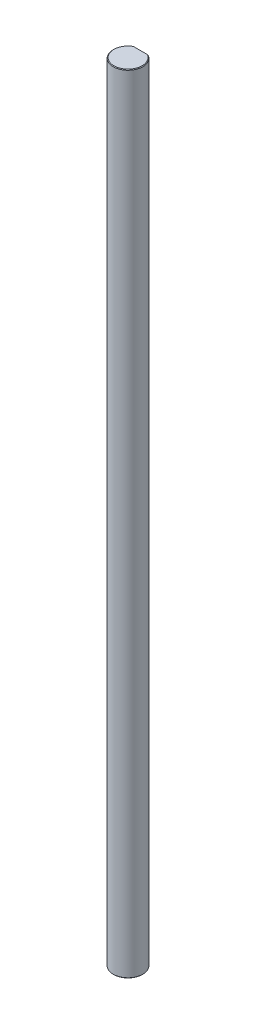
ISO-10303-21;
HEADER;
FILE_DESCRIPTION(('STEP AP214'),'2;1');
FILE_NAME('part.step','',(''),(''),'','','');
FILE_SCHEMA(('AUTOMOTIVE_DESIGN { 1 0 10303 214 1 1 1 1 }'));
ENDSEC;
DATA;
#1=APPLICATION_CONTEXT('core data for automotive mechanical design processes');
#2=APPLICATION_PROTOCOL_DEFINITION('international standard','automotive_design',2000,#1);
#3=PRODUCT_CONTEXT('',#1,'mechanical');
#4=PRODUCT('Part','Part','',(#3));
#5=PRODUCT_RELATED_PRODUCT_CATEGORY('part','',(#4));
#6=PRODUCT_DEFINITION_FORMATION('','',#4);
#7=PRODUCT_DEFINITION_CONTEXT('part definition',#1,'design');
#8=PRODUCT_DEFINITION('design','',#6,#7);
#9=PRODUCT_DEFINITION_SHAPE('','',#8);
#10=(LENGTH_UNIT() NAMED_UNIT(*) SI_UNIT(.MILLI.,.METRE.));
#11=(NAMED_UNIT(*) PLANE_ANGLE_UNIT() SI_UNIT($,.RADIAN.));
#12=(NAMED_UNIT(*) SI_UNIT($,.STERADIAN.) SOLID_ANGLE_UNIT());
#13=UNCERTAINTY_MEASURE_WITH_UNIT(LENGTH_MEASURE(1.E-05),#10,'distance_accuracy_value','');
#14=(GEOMETRIC_REPRESENTATION_CONTEXT(3) GLOBAL_UNCERTAINTY_ASSIGNED_CONTEXT((#13)) GLOBAL_UNIT_ASSIGNED_CONTEXT((#10,
#11,#12)) REPRESENTATION_CONTEXT('',''));
#15=CARTESIAN_POINT('',(0.,0.,0.));
#16=DIRECTION('',(0.,0.,1.));
#17=DIRECTION('',(1.,0.,0.));
#18=AXIS2_PLACEMENT_3D('',#15,#16,#17);
#19=CARTESIAN_POINT('',(0.,160.,0.));
#20=DIRECTION('',(0.,-1.,0.));
#21=DIRECTION('',(0.,0.,-1.));
#22=AXIS2_PLACEMENT_3D('',#19,#20,#21);
#23=CONICAL_SURFACE('',#22,2.875,0.785398163397495);
#24=CARTESIAN_POINT('',(-1.6583123951777,159.875,-2.5));
#25=CARTESIAN_POINT('',(-1.57973572193476,159.918434890403,-2.5));
#26=CARTESIAN_POINT('',(-1.5002290003424,159.960246696465,-2.5));
#27=CARTESIAN_POINT('',(-1.41972708645007,160.,-2.5));
#28=(BOUNDED_CURVE() B_SPLINE_CURVE(3,(#24,#25,#26,#27),.UNSPECIFIED.,.F.,
.F.) B_SPLINE_CURVE_WITH_KNOTS((4,4),(0.,0.000269347265701092),
.UNSPECIFIED.) CURVE() GEOMETRIC_REPRESENTATION_ITEM() RATIONAL_B_SPLINE_CURVE((1.,1.,1.,1.)) REPRESENTATION_ITEM(''));
#29=CARTESIAN_POINT('',(-1.6583123951777,159.875,-2.5));
#30=VERTEX_POINT('',#29);
#31=CARTESIAN_POINT('',(-1.41972708645007,160.,-2.5));
#32=VERTEX_POINT('',#31);
#33=EDGE_CURVE('E132',#30,#32,#28,.T.);
#34=ORIENTED_EDGE('',*,*,#33,.F.);
#35=CARTESIAN_POINT('',(0.,159.875,0.));
#36=DIRECTION('',(0.,-1.,0.));
#37=DIRECTION('',(0.,0.,1.));
#38=AXIS2_PLACEMENT_3D('',#35,#36,#37);
#39=CIRCLE('',#38,3.);
#40=CARTESIAN_POINT('',(1.6583123951777,159.875,-2.5));
#41=VERTEX_POINT('',#40);
#42=EDGE_CURVE('E83',#41,#30,#39,.T.);
#43=ORIENTED_EDGE('',*,*,#42,.F.);
#44=CARTESIAN_POINT('',(1.41972708645007,160.,-2.5));
#45=CARTESIAN_POINT('',(1.50022900034239,159.960246696465,-2.5));
#46=CARTESIAN_POINT('',(1.57973572193477,159.918434890403,-2.5));
#47=CARTESIAN_POINT('',(1.6583123951777,159.875,-2.5));
#48=(BOUNDED_CURVE() B_SPLINE_CURVE(3,(#44,#45,#46,#47),.UNSPECIFIED.,.F.,
.F.) B_SPLINE_CURVE_WITH_KNOTS((4,4),(0.,0.000269347265701092),
.UNSPECIFIED.) CURVE() GEOMETRIC_REPRESENTATION_ITEM() RATIONAL_B_SPLINE_CURVE((1.,1.,1.,1.)) REPRESENTATION_ITEM(''));
#49=CARTESIAN_POINT('',(1.41972708645007,160.,-2.5));
#50=VERTEX_POINT('',#49);
#51=EDGE_CURVE('E89',#50,#41,#48,.T.);
#52=ORIENTED_EDGE('',*,*,#51,.F.);
#53=CARTESIAN_POINT('',(0.,160.,0.));
#54=DIRECTION('',(0.,1.,0.));
#55=DIRECTION('',(0.,0.,1.));
#56=AXIS2_PLACEMENT_3D('',#53,#54,#55);
#57=CIRCLE('',#56,2.875);
#58=EDGE_CURVE('E25',#32,#50,#57,.T.);
#59=ORIENTED_EDGE('',*,*,#58,.F.);
#60=EDGE_LOOP('',(#34,#43,#52,#59));
#61=FACE_BOUND('',#60,.T.);
#62=ADVANCED_FACE('F15',(#61),#23,.T.);
#63=CARTESIAN_POINT('',(0.,0.125000000000014,0.));
#64=DIRECTION('',(0.,1.,0.));
#65=DIRECTION('',(0.,0.,1.));
#66=AXIS2_PLACEMENT_3D('',#63,#64,#65);
#67=CONICAL_SURFACE('',#66,3.,0.785398163397383);
#68=DIRECTION('',(0.,0.707106781186594,0.707106781186501));
#69=VECTOR('',#68,1.);
#70=CARTESIAN_POINT('',(0.,0.125000000000014,3.));
#71=LINE('',#70,#69);
#72=CARTESIAN_POINT('',(0.,0.,2.875));
#73=VERTEX_POINT('',#72);
#74=CARTESIAN_POINT('',(0.,0.125000000000014,3.));
#75=VERTEX_POINT('',#74);
#76=EDGE_CURVE('E112',#73,#75,#71,.T.);
#77=ORIENTED_EDGE('',*,*,#76,.F.);
#78=CARTESIAN_POINT('',(0.,0.,0.));
#79=DIRECTION('',(0.,-1.,0.));
#80=DIRECTION('',(0.,0.,1.));
#81=AXIS2_PLACEMENT_3D('',#78,#79,#80);
#82=CIRCLE('',#81,2.875);
#83=CARTESIAN_POINT('',(1.41972708645007,0.,-2.5));
#84=VERTEX_POINT('',#83);
#85=EDGE_CURVE('E10',#84,#73,#82,.T.);
#86=ORIENTED_EDGE('',*,*,#85,.F.);
#87=CARTESIAN_POINT('',(1.6583123951777,0.125000000000014,-2.5));
#88=CARTESIAN_POINT('',(1.57973572193476,0.0815651095964753,-2.5));
#89=CARTESIAN_POINT('',(1.5002290003424,0.0397533035352817,-2.5));
#90=CARTESIAN_POINT('',(1.41972708645007,0.,-2.5));
#91=(BOUNDED_CURVE() B_SPLINE_CURVE(3,(#87,#88,#89,#90),.UNSPECIFIED.,.F.,
.F.) B_SPLINE_CURVE_WITH_KNOTS((4,4),(0.,0.000269347265701101),
.UNSPECIFIED.) CURVE() GEOMETRIC_REPRESENTATION_ITEM() RATIONAL_B_SPLINE_CURVE((1.,1.,1.,1.)) REPRESENTATION_ITEM(''));
#92=CARTESIAN_POINT('',(1.6583123951777,0.125000000000014,-2.5));
#93=VERTEX_POINT('',#92);
#94=EDGE_CURVE('E72',#93,#84,#91,.T.);
#95=ORIENTED_EDGE('',*,*,#94,.F.);
#96=CARTESIAN_POINT('',(0.,0.125000000000014,0.));
#97=DIRECTION('',(0.,1.,0.));
#98=DIRECTION('',(0.,0.,1.));
#99=AXIS2_PLACEMENT_3D('',#96,#97,#98);
#100=CIRCLE('',#99,3.);
#101=EDGE_CURVE('E77',#75,#93,#100,.T.);
#102=ORIENTED_EDGE('',*,*,#101,.F.);
#103=EDGE_LOOP('',(#77,#86,#95,#102));
#104=FACE_BOUND('',#103,.T.);
#105=ADVANCED_FACE('F75',(#104),#67,.T.);
#106=CARTESIAN_POINT('',(0.,0.,0.));
#107=DIRECTION('',(0.,1.,0.));
#108=DIRECTION('',(1.,0.,0.));
#109=AXIS2_PLACEMENT_3D('',#106,#107,#108);
#110=PLANE('',#109);
#111=DIRECTION('',(1.,0.,0.));
#112=VECTOR('',#111,1.);
#113=CARTESIAN_POINT('',(0.,0.,-2.5));
#114=LINE('',#113,#112);
#115=CARTESIAN_POINT('',(-1.41972708645007,0.,-2.5));
#116=VERTEX_POINT('',#115);
#117=EDGE_CURVE('E82',#116,#84,#114,.T.);
#118=ORIENTED_EDGE('',*,*,#117,.T.);
#119=ORIENTED_EDGE('',*,*,#85,.T.);
#120=CARTESIAN_POINT('',(0.,0.,0.));
#121=DIRECTION('',(0.,-1.,0.));
#122=DIRECTION('',(0.,0.,1.));
#123=AXIS2_PLACEMENT_3D('',#120,#121,#122);
#124=CIRCLE('',#123,2.875);
#125=EDGE_CURVE('E110',#73,#116,#124,.T.);
#126=ORIENTED_EDGE('',*,*,#125,.T.);
#127=EDGE_LOOP('',(#118,#119,#126));
#128=FACE_BOUND('',#127,.T.);
#129=ADVANCED_FACE('F149',(#128),#110,.F.);
#130=CARTESIAN_POINT('',(0.,160.,0.));
#131=DIRECTION('',(0.,1.,0.));
#132=DIRECTION('',(1.,0.,0.));
#133=AXIS2_PLACEMENT_3D('',#130,#131,#132);
#134=PLANE('',#133);
#135=DIRECTION('',(1.,0.,0.));
#136=VECTOR('',#135,1.);
#137=CARTESIAN_POINT('',(0.,160.,-2.5));
#138=LINE('',#137,#136);
#139=EDGE_CURVE('E18',#32,#50,#138,.T.);
#140=ORIENTED_EDGE('',*,*,#139,.F.);
#141=ORIENTED_EDGE('',*,*,#58,.T.);
#142=EDGE_LOOP('',(#140,#141));
#143=FACE_BOUND('',#142,.T.);
#144=ADVANCED_FACE('F218',(#143),#134,.T.);
#145=CARTESIAN_POINT('',(0.,160.,-2.5));
#146=DIRECTION('',(0.,0.,-1.));
#147=DIRECTION('',(0.,-1.,0.));
#148=AXIS2_PLACEMENT_3D('',#145,#146,#147);
#149=PLANE('',#148);
#150=DIRECTION('',(0.,-1.,0.));
#151=VECTOR('',#150,1.);
#152=CARTESIAN_POINT('',(1.6583123951777,160.,-2.5));
#153=LINE('',#152,#151);
#154=EDGE_CURVE('E86',#41,#93,#153,.T.);
#155=ORIENTED_EDGE('',*,*,#154,.T.);
#156=ORIENTED_EDGE('',*,*,#94,.T.);
#157=ORIENTED_EDGE('',*,*,#117,.F.);
#158=CARTESIAN_POINT('',(-1.41972708645007,0.,-2.5));
#159=CARTESIAN_POINT('',(-1.50022900034239,0.0397533035353055,-2.5));
#160=CARTESIAN_POINT('',(-1.57973572193477,0.0815651095964628,-2.5));
#161=CARTESIAN_POINT('',(-1.6583123951777,0.125000000000014,-2.5));
#162=(BOUNDED_CURVE() B_SPLINE_CURVE(3,(#158,#159,#160,#161),.UNSPECIFIED.,.F.,
.F.) B_SPLINE_CURVE_WITH_KNOTS((4,4),(0.,0.000269347265701101),
.UNSPECIFIED.) CURVE() GEOMETRIC_REPRESENTATION_ITEM() RATIONAL_B_SPLINE_CURVE((1.,1.,1.,1.)) REPRESENTATION_ITEM(''));
#163=CARTESIAN_POINT('',(-1.6583123951777,0.125000000000014,-2.5));
#164=VERTEX_POINT('',#163);
#165=EDGE_CURVE('E106',#116,#164,#162,.T.);
#166=ORIENTED_EDGE('',*,*,#165,.T.);
#167=DIRECTION('',(0.,-1.,0.));
#168=VECTOR('',#167,1.);
#169=CARTESIAN_POINT('',(-1.6583123951777,160.,-2.5));
#170=LINE('',#169,#168);
#171=EDGE_CURVE('E99',#30,#164,#170,.T.);
#172=ORIENTED_EDGE('',*,*,#171,.F.);
#173=ORIENTED_EDGE('',*,*,#33,.T.);
#174=ORIENTED_EDGE('',*,*,#139,.T.);
#175=ORIENTED_EDGE('',*,*,#51,.T.);
#176=EDGE_LOOP('',(#155,#156,#157,#166,#172,#173,#174,#175));
#177=FACE_BOUND('',#176,.T.);
#178=ADVANCED_FACE('F87',(#177),#149,.T.);
#179=CARTESIAN_POINT('',(0.,160.,0.));
#180=DIRECTION('',(0.,-1.,0.));
#181=DIRECTION('',(0.,0.,-1.));
#182=AXIS2_PLACEMENT_3D('',#179,#180,#181);
#183=CYLINDRICAL_SURFACE('',#182,3.);
#184=ORIENTED_EDGE('',*,*,#171,.T.);
#185=CARTESIAN_POINT('',(0.,0.125000000000014,0.));
#186=DIRECTION('',(0.,1.,0.));
#187=DIRECTION('',(0.,0.,1.));
#188=AXIS2_PLACEMENT_3D('',#185,#186,#187);
#189=CIRCLE('',#188,3.);
#190=EDGE_CURVE('E96',#164,#75,#189,.T.);
#191=ORIENTED_EDGE('',*,*,#190,.T.);
#192=ORIENTED_EDGE('',*,*,#101,.T.);
#193=ORIENTED_EDGE('',*,*,#154,.F.);
#194=ORIENTED_EDGE('',*,*,#42,.T.);
#195=EDGE_LOOP('',(#184,#191,#192,#193,#194));
#196=FACE_BOUND('',#195,.T.);
#197=ADVANCED_FACE('F94',(#196),#183,.T.);
#198=CARTESIAN_POINT('',(0.,0.125000000000014,0.));
#199=DIRECTION('',(0.,1.,0.));
#200=DIRECTION('',(0.,0.,1.));
#201=AXIS2_PLACEMENT_3D('',#198,#199,#200);
#202=CONICAL_SURFACE('',#201,3.,0.785398163397383);
#203=ORIENTED_EDGE('',*,*,#125,.F.);
#204=ORIENTED_EDGE('',*,*,#76,.T.);
#205=ORIENTED_EDGE('',*,*,#190,.F.);
#206=ORIENTED_EDGE('',*,*,#165,.F.);
#207=EDGE_LOOP('',(#203,#204,#205,#206));
#208=FACE_BOUND('',#207,.T.);
#209=ADVANCED_FACE('F152',(#208),#202,.T.);
#210=CLOSED_SHELL('',(#62,#105,#129,#144,#178,#197,#209));
#211=MANIFOLD_SOLID_BREP('B1',#210);
#212=ADVANCED_BREP_SHAPE_REPRESENTATION('',(#18,#211),#14);
#213=SHAPE_DEFINITION_REPRESENTATION(#9,#212);
ENDSEC;
END-ISO-10303-21;
